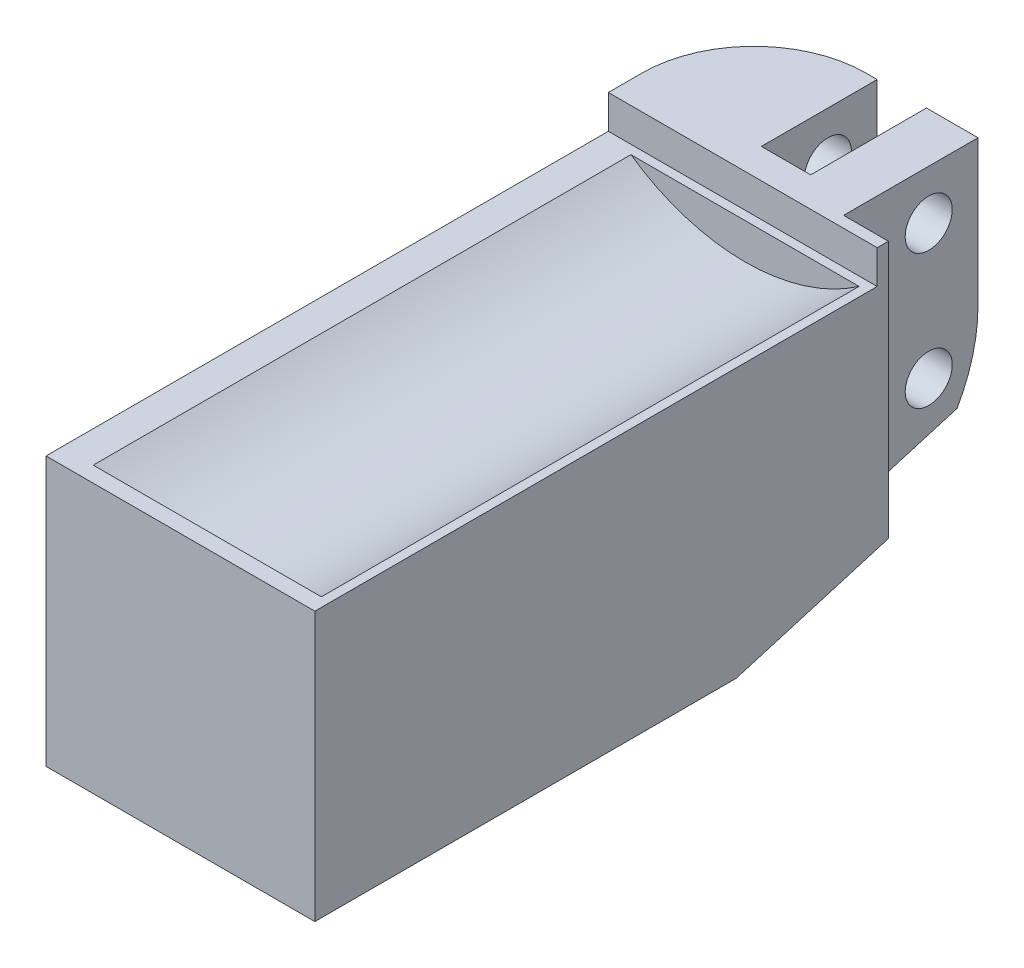
ISO-10303-21;
HEADER;
FILE_DESCRIPTION(('STEP AP214'),'2;1');
FILE_NAME('part.step','',(''),(''),'','','');
FILE_SCHEMA(('AUTOMOTIVE_DESIGN { 1 0 10303 214 1 1 1 1 }'));
ENDSEC;
DATA;
#1=APPLICATION_CONTEXT('core data for automotive mechanical design processes');
#2=APPLICATION_PROTOCOL_DEFINITION('international standard','automotive_design',2000,#1);
#3=PRODUCT_CONTEXT('',#1,'mechanical');
#4=PRODUCT('Part','Part','',(#3));
#5=PRODUCT_RELATED_PRODUCT_CATEGORY('part','',(#4));
#6=PRODUCT_DEFINITION_FORMATION('','',#4);
#7=PRODUCT_DEFINITION_CONTEXT('part definition',#1,'design');
#8=PRODUCT_DEFINITION('design','',#6,#7);
#9=PRODUCT_DEFINITION_SHAPE('','',#8);
#10=(LENGTH_UNIT() NAMED_UNIT(*) SI_UNIT(.MILLI.,.METRE.));
#11=(NAMED_UNIT(*) PLANE_ANGLE_UNIT() SI_UNIT($,.RADIAN.));
#12=(NAMED_UNIT(*) SI_UNIT($,.STERADIAN.) SOLID_ANGLE_UNIT());
#13=UNCERTAINTY_MEASURE_WITH_UNIT(LENGTH_MEASURE(1.E-05),#10,'distance_accuracy_value','');
#14=(GEOMETRIC_REPRESENTATION_CONTEXT(3) GLOBAL_UNCERTAINTY_ASSIGNED_CONTEXT((#13)) GLOBAL_UNIT_ASSIGNED_CONTEXT((#10,
#11,#12)) REPRESENTATION_CONTEXT('',''));
#15=CARTESIAN_POINT('',(0.,0.,0.));
#16=DIRECTION('',(0.,0.,1.));
#17=DIRECTION('',(1.,0.,0.));
#18=AXIS2_PLACEMENT_3D('',#15,#16,#17);
#19=CARTESIAN_POINT('',(119.,-32.5,-9.3));
#20=DIRECTION('',(-1.,0.,0.));
#21=DIRECTION('',(0.,0.,1.));
#22=AXIS2_PLACEMENT_3D('',#19,#20,#21);
#23=CYLINDRICAL_SURFACE('',#22,3.5);
#24=DIRECTION('',(-1.,0.,0.));
#25=VECTOR('',#24,1.);
#26=CARTESIAN_POINT('',(119.,-34.2494889216899,-12.3313839270017));
#27=LINE('',#26,#25);
#28=CARTESIAN_POINT('',(120.042783701327,-34.2494889216899,-12.3313839270017));
#29=VERTEX_POINT('',#28);
#30=CARTESIAN_POINT('',(121.75,-34.2494889216899,-12.3313839270017));
#31=VERTEX_POINT('',#30);
#32=EDGE_CURVE('E185',#29,#31,#27,.F.);
#33=ORIENTED_EDGE('',*,*,#32,.F.);
#34=CARTESIAN_POINT('',(119.,-35.8541019662497,-10.3));
#35=CARTESIAN_POINT('',(118.999988047983,-35.8338175600791,-10.3680954157907));
#36=CARTESIAN_POINT('',(119.002781171359,-35.811438180757,-10.435528450473));
#37=CARTESIAN_POINT('',(119.013566583995,-35.7628159711116,-10.5684645695911));
#38=CARTESIAN_POINT('',(119.021551963303,-35.7365783113211,-10.6339700982563));
#39=CARTESIAN_POINT('',(119.042216839472,-35.6807703446585,-10.7620335653267));
#40=CARTESIAN_POINT('',(119.054852155966,-35.6512331700846,-10.8246131915429));
#41=CARTESIAN_POINT('',(119.084383184073,-35.5889660439499,-10.9471235207846));
#42=CARTESIAN_POINT('',(119.101280246841,-35.5562350818447,-11.0070533766252));
#43=CARTESIAN_POINT('',(119.157500642327,-35.4541264746393,-11.1818187198834));
#44=CARTESIAN_POINT('',(119.202488569198,-35.3804884441263,-11.2924089484076));
#45=CARTESIAN_POINT('',(119.304426326725,-35.2242537722305,-11.5012606983842));
#46=CARTESIAN_POINT('',(119.361408356519,-35.141633311444,-11.599487872419));
#47=CARTESIAN_POINT('',(119.520936962632,-34.9187893227612,-11.8376213129414));
#48=CARTESIAN_POINT('',(119.63053498836,-34.7733331522809,-11.9679384212429));
#49=CARTESIAN_POINT('',(119.86503353588,-34.4711432111932,-12.1984267336067));
#50=CARTESIAN_POINT('',(119.989971928102,-34.3143819417854,-12.2985211337983));
#51=CARTESIAN_POINT('',(120.207804917403,-34.0454260941259,-12.4427442612138));
#52=CARTESIAN_POINT('',(120.298084557525,-33.9351101595503,-12.4945194265165));
#53=CARTESIAN_POINT('',(120.48194455528,-33.7120916329477,-12.5856289266947));
#54=CARTESIAN_POINT('',(120.575526318667,-33.5993880328242,-12.6249578902832));
#55=CARTESIAN_POINT('',(120.859321598635,-33.2592425154894,-12.7248113278427));
#56=CARTESIAN_POINT('',(121.053053297697,-33.0291935020995,-12.7675000629));
#57=CARTESIAN_POINT('',(121.329168210894,-32.7021354234193,-12.7954968708602));
#58=CARTESIAN_POINT('',(121.410759511203,-32.6055909071279,-12.7997391135888));
#59=CARTESIAN_POINT('',(121.494908240545,-32.5060246498733,-12.7999961085257));
#60=CARTESIAN_POINT('',(121.497454117018,-32.5030123281731,-12.7999999972126));
#61=CARTESIAN_POINT('',(121.5,-32.5,-12.8));
#62=B_SPLINE_CURVE_WITH_KNOTS('',3,(#34,#35,#36,#37,#38,#39,#40,#41,#42,#43,#44,#45,#46,#47,#48,
#49,#50,#51,#52,#53,#54,#55,#56,#57,#58,#59,#60,#61),.UNSPECIFIED.,.F.,.F.,(4,2,2,2,2,2,2,2,2,2,
2,2,2,4),(0.,0.213014333672373,0.42574576248234,0.636506063228314,0.847333268093255,
1.26643070813804,1.68666793580815,2.3547711927174,3.02455825693559,3.4789654617576,
3.9335685041186,4.84041086672273,5.21966840636038,5.23150057167835),.UNSPECIFIED.);
#63=CARTESIAN_POINT('',(121.5,-32.5,-12.8));
#64=VERTEX_POINT('',#63);
#65=EDGE_CURVE('E248',#64,#29,#62,.F.);
#66=ORIENTED_EDGE('',*,*,#65,.F.);
#67=DIRECTION('',(1.,0.,0.));
#68=VECTOR('',#67,1.);
#69=CARTESIAN_POINT('',(119.,-32.5,-12.8));
#70=LINE('',#69,#68);
#71=CARTESIAN_POINT('',(121.75,-32.5,-12.8));
#72=VERTEX_POINT('',#71);
#73=EDGE_CURVE('E60',#72,#64,#70,.F.);
#74=ORIENTED_EDGE('',*,*,#73,.F.);
#75=CARTESIAN_POINT('',(121.75,-32.5,-9.3));
#76=DIRECTION('',(-1.,0.,0.));
#77=DIRECTION('',(0.,-1.,0.));
#78=AXIS2_PLACEMENT_3D('',#75,#76,#77);
#79=CIRCLE('',#78,3.5);
#80=EDGE_CURVE('E46',#31,#72,#79,.F.);
#81=ORIENTED_EDGE('',*,*,#80,.F.);
#82=EDGE_LOOP('',(#33,#66,#74,#81));
#83=FACE_BOUND('',#82,.T.);
#84=ADVANCED_FACE('F37',(#83),#23,.T.);
#85=CARTESIAN_POINT('',(0.,0.,-12.8));
#86=DIRECTION('',(0.,0.,1.));
#87=DIRECTION('',(1.,0.,0.));
#88=AXIS2_PLACEMENT_3D('',#85,#86,#87);
#89=PLANE('',#88);
#90=DIRECTION('',(0.,1.,0.));
#91=VECTOR('',#90,1.);
#92=CARTESIAN_POINT('',(124.,-36.,-12.8));
#93=LINE('',#92,#91);
#94=CARTESIAN_POINT('',(124.,-32.5,-12.8));
#95=VERTEX_POINT('',#94);
#96=CARTESIAN_POINT('',(124.,-29.25,-12.8));
#97=VERTEX_POINT('',#96);
#98=EDGE_CURVE('E430',#95,#97,#93,.T.);
#99=ORIENTED_EDGE('',*,*,#98,.F.);
#100=DIRECTION('',(1.,0.,0.));
#101=VECTOR('',#100,1.);
#102=CARTESIAN_POINT('',(119.,-32.5,-12.8));
#103=LINE('',#102,#101);
#104=CARTESIAN_POINT('',(122.85,-32.5,-12.8));
#105=VERTEX_POINT('',#104);
#106=EDGE_CURVE('E238',#95,#105,#103,.F.);
#107=ORIENTED_EDGE('',*,*,#106,.T.);
#108=DIRECTION('',(0.,1.,0.));
#109=VECTOR('',#108,1.);
#110=CARTESIAN_POINT('',(122.85,0.,-12.8));
#111=LINE('',#110,#109);
#112=CARTESIAN_POINT('',(122.85,-29.25,-12.8));
#113=VERTEX_POINT('',#112);
#114=EDGE_CURVE('E373',#105,#113,#111,.T.);
#115=ORIENTED_EDGE('',*,*,#114,.T.);
#116=DIRECTION('',(-1.,0.,0.));
#117=VECTOR('',#116,1.);
#118=CARTESIAN_POINT('',(119.,-29.25,-12.8));
#119=LINE('',#118,#117);
#120=EDGE_CURVE('E386',#97,#113,#119,.T.);
#121=ORIENTED_EDGE('',*,*,#120,.F.);
#122=EDGE_LOOP('',(#99,#107,#115,#121));
#123=FACE_BOUND('',#122,.T.);
#124=ADVANCED_FACE('F271',(#123),#89,.F.);
#125=CARTESIAN_POINT('',(119.,-30.,-12.8));
#126=DIRECTION('',(-1.,0.,0.));
#127=DIRECTION('',(0.,0.,1.));
#128=AXIS2_PLACEMENT_3D('',#125,#126,#127);
#129=PLANE('',#128);
#130=DIRECTION('',(0.,0.283267438048704,-0.959040957697493));
#131=VECTOR('',#130,1.);
#132=CARTESIAN_POINT('',(119.,-36.,-6.40478737722839));
#133=LINE('',#132,#131);
#134=CARTESIAN_POINT('',(119.,-36.,-6.40478737722839));
#135=VERTEX_POINT('',#134);
#136=CARTESIAN_POINT('',(119.,-34.8494892825469,-10.3));
#137=VERTEX_POINT('',#136);
#138=EDGE_CURVE('E52',#135,#137,#133,.T.);
#139=ORIENTED_EDGE('',*,*,#138,.F.);
#140=DIRECTION('',(0.,0.,1.));
#141=VECTOR('',#140,1.);
#142=CARTESIAN_POINT('',(119.,-36.,-12.8));
#143=LINE('',#142,#141);
#144=CARTESIAN_POINT('',(119.,-36.,3.));
#145=VERTEX_POINT('',#144);
#146=EDGE_CURVE('E184',#135,#145,#143,.T.);
#147=ORIENTED_EDGE('',*,*,#146,.T.);
#148=DIRECTION('',(0.,-1.,0.));
#149=VECTOR('',#148,1.);
#150=CARTESIAN_POINT('',(119.,-30.,3.));
#151=LINE('',#150,#149);
#152=CARTESIAN_POINT('',(119.,-30.,3.));
#153=VERTEX_POINT('',#152);
#154=EDGE_CURVE('E397',#153,#145,#151,.T.);
#155=ORIENTED_EDGE('',*,*,#154,.F.);
#156=DIRECTION('',(0.,0.,1.));
#157=VECTOR('',#156,1.);
#158=CARTESIAN_POINT('',(119.,-30.,-12.8));
#159=LINE('',#158,#157);
#160=CARTESIAN_POINT('',(119.,-30.,-9.55));
#161=VERTEX_POINT('',#160);
#162=EDGE_CURVE('E193',#161,#153,#159,.T.);
#163=ORIENTED_EDGE('',*,*,#162,.F.);
#164=DIRECTION('',(0.,-1.,0.));
#165=VECTOR('',#164,1.);
#166=CARTESIAN_POINT('',(119.,-29.25,-9.55));
#167=LINE('',#166,#165);
#168=CARTESIAN_POINT('',(119.,-29.25,-9.55));
#169=VERTEX_POINT('',#168);
#170=EDGE_CURVE('E394',#169,#161,#167,.T.);
#171=ORIENTED_EDGE('',*,*,#170,.F.);
#172=DIRECTION('',(0.,0.,1.));
#173=VECTOR('',#172,1.);
#174=CARTESIAN_POINT('',(119.,-29.25,-12.8));
#175=LINE('',#174,#173);
#176=CARTESIAN_POINT('',(119.,-29.25,-10.3));
#177=VERTEX_POINT('',#176);
#178=EDGE_CURVE('E378',#177,#169,#175,.T.);
#179=ORIENTED_EDGE('',*,*,#178,.F.);
#180=DIRECTION('',(0.,-1.,0.));
#181=VECTOR('',#180,1.);
#182=CARTESIAN_POINT('',(119.,-36.,-10.3));
#183=LINE('',#182,#181);
#184=EDGE_CURVE('E218',#177,#137,#183,.T.);
#185=ORIENTED_EDGE('',*,*,#184,.T.);
#186=EDGE_LOOP('',(#139,#147,#155,#163,#171,#179,#185));
#187=FACE_BOUND('',#186,.T.);
#188=ADVANCED_FACE('F267',(#187),#129,.T.);
#189=CARTESIAN_POINT('',(119.,-30.,-12.8));
#190=DIRECTION('',(0.,1.,0.));
#191=DIRECTION('',(0.,0.,1.));
#192=AXIS2_PLACEMENT_3D('',#189,#190,#191);
#193=PLANE('',#192);
#194=DIRECTION('',(-1.,0.,0.));
#195=VECTOR('',#194,1.);
#196=CARTESIAN_POINT('',(119.,-30.,-9.35000000000001));
#197=LINE('',#196,#195);
#198=CARTESIAN_POINT('',(124.795584412272,-30.,-9.35000000000001));
#199=VERTEX_POINT('',#198);
#200=CARTESIAN_POINT('',(119.704415587728,-30.,-9.35000000000001));
#201=VERTEX_POINT('',#200);
#202=EDGE_CURVE('E216',#199,#201,#197,.T.);
#203=ORIENTED_EDGE('',*,*,#202,.F.);
#204=DIRECTION('',(0.,0.,1.));
#205=VECTOR('',#204,1.);
#206=CARTESIAN_POINT('',(124.795584412272,-30.,-9.35000000000001));
#207=LINE('',#206,#205);
#208=CARTESIAN_POINT('',(124.795584412272,-30.,2.64999999999999));
#209=VERTEX_POINT('',#208);
#210=EDGE_CURVE('E210',#199,#209,#207,.T.);
#211=ORIENTED_EDGE('',*,*,#210,.T.);
#212=DIRECTION('',(-1.,0.,0.));
#213=VECTOR('',#212,1.);
#214=CARTESIAN_POINT('',(119.,-30.,2.64999999999999));
#215=LINE('',#214,#213);
#216=CARTESIAN_POINT('',(119.704415587728,-30.,2.64999999999999));
#217=VERTEX_POINT('',#216);
#218=EDGE_CURVE('E207',#209,#217,#215,.T.);
#219=ORIENTED_EDGE('',*,*,#218,.T.);
#220=DIRECTION('',(0.,0.,1.));
#221=VECTOR('',#220,1.);
#222=CARTESIAN_POINT('',(119.704415587728,-30.,-9.35000000000001));
#223=LINE('',#222,#221);
#224=EDGE_CURVE('E213',#217,#201,#223,.F.);
#225=ORIENTED_EDGE('',*,*,#224,.T.);
#226=EDGE_LOOP('',(#203,#211,#219,#225));
#227=FACE_BOUND('',#226,.T.);
#228=DIRECTION('',(1.,0.,0.));
#229=VECTOR('',#228,1.);
#230=CARTESIAN_POINT('',(119.,-30.,-9.55));
#231=LINE('',#230,#229);
#232=CARTESIAN_POINT('',(125.,-30.,-9.55));
#233=VERTEX_POINT('',#232);
#234=EDGE_CURVE('E377',#161,#233,#231,.T.);
#235=ORIENTED_EDGE('',*,*,#234,.F.);
#236=ORIENTED_EDGE('',*,*,#162,.T.);
#237=DIRECTION('',(-1.,0.,0.));
#238=VECTOR('',#237,1.);
#239=CARTESIAN_POINT('',(119.,-30.,3.));
#240=LINE('',#239,#238);
#241=CARTESIAN_POINT('',(125.,-30.,3.));
#242=VERTEX_POINT('',#241);
#243=EDGE_CURVE('E195',#242,#153,#240,.T.);
#244=ORIENTED_EDGE('',*,*,#243,.F.);
#245=DIRECTION('',(0.,0.,1.));
#246=VECTOR('',#245,1.);
#247=CARTESIAN_POINT('',(125.,-30.,-12.8));
#248=LINE('',#247,#246);
#249=EDGE_CURVE('E191',#233,#242,#248,.T.);
#250=ORIENTED_EDGE('',*,*,#249,.F.);
#251=EDGE_LOOP('',(#235,#236,#244,#250));
#252=FACE_BOUND('',#251,.T.);
#253=ADVANCED_FACE('F270',(#227,#252),#193,.T.);
#254=CARTESIAN_POINT('',(125.,-30.,-12.8));
#255=DIRECTION('',(1.,0.,0.));
#256=DIRECTION('',(0.,0.,-1.));
#257=AXIS2_PLACEMENT_3D('',#254,#255,#256);
#258=PLANE('',#257);
#259=DIRECTION('',(0.,0.283267438048704,-0.959040957697493));
#260=VECTOR('',#259,1.);
#261=CARTESIAN_POINT('',(125.,-36.,-6.40478737722839));
#262=LINE('',#261,#260);
#263=CARTESIAN_POINT('',(125.,-36.,-6.40478737722839));
#264=VERTEX_POINT('',#263);
#265=CARTESIAN_POINT('',(125.,-34.9971719418614,-9.8));
#266=VERTEX_POINT('',#265);
#267=EDGE_CURVE('E167',#264,#266,#262,.T.);
#268=ORIENTED_EDGE('',*,*,#267,.T.);
#269=DIRECTION('',(0.,-1.,0.));
#270=VECTOR('',#269,1.);
#271=CARTESIAN_POINT('',(125.,-36.,-9.8));
#272=LINE('',#271,#270);
#273=CARTESIAN_POINT('',(125.,-29.25,-9.8));
#274=VERTEX_POINT('',#273);
#275=EDGE_CURVE('E255',#274,#266,#272,.T.);
#276=ORIENTED_EDGE('',*,*,#275,.F.);
#277=DIRECTION('',(0.,0.,-1.));
#278=VECTOR('',#277,1.);
#279=CARTESIAN_POINT('',(125.,-29.25,-12.8));
#280=LINE('',#279,#278);
#281=CARTESIAN_POINT('',(125.,-29.25,-9.55));
#282=VERTEX_POINT('',#281);
#283=EDGE_CURVE('E382',#282,#274,#280,.T.);
#284=ORIENTED_EDGE('',*,*,#283,.F.);
#285=DIRECTION('',(0.,-1.,0.));
#286=VECTOR('',#285,1.);
#287=CARTESIAN_POINT('',(125.,-29.25,-9.55));
#288=LINE('',#287,#286);
#289=EDGE_CURVE('E389',#282,#233,#288,.T.);
#290=ORIENTED_EDGE('',*,*,#289,.T.);
#291=ORIENTED_EDGE('',*,*,#249,.T.);
#292=DIRECTION('',(0.,1.,0.));
#293=VECTOR('',#292,1.);
#294=CARTESIAN_POINT('',(125.,-30.,3.));
#295=LINE('',#294,#293);
#296=CARTESIAN_POINT('',(125.,-36.,3.));
#297=VERTEX_POINT('',#296);
#298=EDGE_CURVE('E190',#297,#242,#295,.T.);
#299=ORIENTED_EDGE('',*,*,#298,.F.);
#300=DIRECTION('',(0.,0.,1.));
#301=VECTOR('',#300,1.);
#302=CARTESIAN_POINT('',(125.,-36.,-12.8));
#303=LINE('',#302,#301);
#304=EDGE_CURVE('E182',#264,#297,#303,.T.);
#305=ORIENTED_EDGE('',*,*,#304,.F.);
#306=EDGE_LOOP('',(#268,#276,#284,#290,#291,#299,#305));
#307=FACE_BOUND('',#306,.T.);
#308=ADVANCED_FACE('F188',(#307),#258,.T.);
#309=CARTESIAN_POINT('',(119.,-36.,-12.8));
#310=DIRECTION('',(0.,-1.,0.));
#311=DIRECTION('',(0.,0.,-1.));
#312=AXIS2_PLACEMENT_3D('',#309,#310,#311);
#313=PLANE('',#312);
#314=DIRECTION('',(-1.,0.,0.));
#315=VECTOR('',#314,1.);
#316=CARTESIAN_POINT('',(125.,-36.,-6.40478737722839));
#317=LINE('',#316,#315);
#318=EDGE_CURVE('E170',#264,#135,#317,.T.);
#319=ORIENTED_EDGE('',*,*,#318,.F.);
#320=ORIENTED_EDGE('',*,*,#304,.T.);
#321=DIRECTION('',(1.,0.,0.));
#322=VECTOR('',#321,1.);
#323=CARTESIAN_POINT('',(119.,-36.,3.));
#324=LINE('',#323,#322);
#325=EDGE_CURVE('E400',#145,#297,#324,.T.);
#326=ORIENTED_EDGE('',*,*,#325,.F.);
#327=ORIENTED_EDGE('',*,*,#146,.F.);
#328=EDGE_LOOP('',(#319,#320,#326,#327));
#329=FACE_BOUND('',#328,.T.);
#330=ADVANCED_FACE('F180',(#329),#313,.T.);
#331=ORIENTED_EDGE('',*,*,#73,.T.);
#332=DIRECTION('',(0.,-1.,0.));
#333=VECTOR('',#332,1.);
#334=CARTESIAN_POINT('',(121.5,-29.25,-12.8));
#335=LINE('',#334,#333);
#336=CARTESIAN_POINT('',(121.5,-29.25,-12.8));
#337=VERTEX_POINT('',#336);
#338=EDGE_CURVE('E236',#64,#337,#335,.F.);
#339=ORIENTED_EDGE('',*,*,#338,.T.);
#340=CARTESIAN_POINT('',(121.75,-29.25,-12.8));
#341=VERTEX_POINT('',#340);
#342=EDGE_CURVE('E385',#341,#337,#119,.T.);
#343=ORIENTED_EDGE('',*,*,#342,.F.);
#344=DIRECTION('',(0.,-1.,0.));
#345=VECTOR('',#344,1.);
#346=CARTESIAN_POINT('',(121.75,0.,-12.8));
#347=LINE('',#346,#345);
#348=EDGE_CURVE('E375',#341,#72,#347,.T.);
#349=ORIENTED_EDGE('',*,*,#348,.T.);
#350=EDGE_LOOP('',(#331,#339,#343,#349));
#351=FACE_BOUND('',#350,.T.);
#352=ADVANCED_FACE('F275',(#351),#89,.F.);
#353=CARTESIAN_POINT('',(0.,0.,3.));
#354=DIRECTION('',(0.,0.,1.));
#355=DIRECTION('',(1.,0.,0.));
#356=AXIS2_PLACEMENT_3D('',#353,#354,#355);
#357=PLANE('',#356);
#358=ORIENTED_EDGE('',*,*,#154,.T.);
#359=ORIENTED_EDGE('',*,*,#325,.T.);
#360=ORIENTED_EDGE('',*,*,#298,.T.);
#361=ORIENTED_EDGE('',*,*,#243,.T.);
#362=EDGE_LOOP('',(#358,#359,#360,#361));
#363=FACE_BOUND('',#362,.T.);
#364=ADVANCED_FACE('F283',(#363),#357,.T.);
#365=CARTESIAN_POINT('',(119.,-29.25,-9.55));
#366=DIRECTION('',(0.,0.,-1.));
#367=DIRECTION('',(-1.,0.,0.));
#368=AXIS2_PLACEMENT_3D('',#365,#366,#367);
#369=PLANE('',#368);
#370=ORIENTED_EDGE('',*,*,#234,.T.);
#371=ORIENTED_EDGE('',*,*,#289,.F.);
#372=DIRECTION('',(1.,0.,0.));
#373=VECTOR('',#372,1.);
#374=CARTESIAN_POINT('',(119.,-29.25,-9.55));
#375=LINE('',#374,#373);
#376=EDGE_CURVE('E380',#169,#282,#375,.T.);
#377=ORIENTED_EDGE('',*,*,#376,.F.);
#378=ORIENTED_EDGE('',*,*,#170,.T.);
#379=EDGE_LOOP('',(#370,#371,#377,#378));
#380=FACE_BOUND('',#379,.T.);
#381=ADVANCED_FACE('F286',(#380),#369,.F.);
#382=CARTESIAN_POINT('',(0.,-29.25,0.));
#383=DIRECTION('',(0.,1.,0.));
#384=DIRECTION('',(0.,0.,1.));
#385=AXIS2_PLACEMENT_3D('',#382,#383,#384);
#386=PLANE('',#385);
#387=ORIENTED_EDGE('',*,*,#342,.T.);
#388=CARTESIAN_POINT('',(121.5,-29.25,-10.3));
#389=DIRECTION('',(0.,1.,0.));
#390=DIRECTION('',(0.,0.,1.));
#391=AXIS2_PLACEMENT_3D('',#388,#389,#390);
#392=CIRCLE('',#391,2.5);
#393=EDGE_CURVE('E240',#337,#177,#392,.T.);
#394=ORIENTED_EDGE('',*,*,#393,.T.);
#395=ORIENTED_EDGE('',*,*,#178,.T.);
#396=ORIENTED_EDGE('',*,*,#376,.T.);
#397=ORIENTED_EDGE('',*,*,#283,.T.);
#398=DIRECTION('',(1.,0.,0.));
#399=VECTOR('',#398,1.);
#400=CARTESIAN_POINT('',(124.,-29.25,-9.8));
#401=LINE('',#400,#399);
#402=CARTESIAN_POINT('',(124.,-29.25,-9.8));
#403=VERTEX_POINT('',#402);
#404=EDGE_CURVE('E232',#403,#274,#401,.T.);
#405=ORIENTED_EDGE('',*,*,#404,.F.);
#406=DIRECTION('',(0.,0.,1.));
#407=VECTOR('',#406,1.);
#408=CARTESIAN_POINT('',(124.,-29.25,-9.8));
#409=LINE('',#408,#407);
#410=EDGE_CURVE('E432',#97,#403,#409,.T.);
#411=ORIENTED_EDGE('',*,*,#410,.F.);
#412=ORIENTED_EDGE('',*,*,#120,.T.);
#413=DIRECTION('',(0.,0.,-1.));
#414=VECTOR('',#413,1.);
#415=CARTESIAN_POINT('',(122.85,-29.25,0.));
#416=LINE('',#415,#414);
#417=CARTESIAN_POINT('',(122.85,-29.25,-10.2151462676297));
#418=VERTEX_POINT('',#417);
#419=EDGE_CURVE('E199',#418,#113,#416,.T.);
#420=ORIENTED_EDGE('',*,*,#419,.F.);
#421=DIRECTION('',(-1.,0.,0.));
#422=VECTOR('',#421,1.);
#423=CARTESIAN_POINT('',(0.,-29.25,-10.2151462676297));
#424=LINE('',#423,#422);
#425=CARTESIAN_POINT('',(121.75,-29.25,-10.2151462676297));
#426=VERTEX_POINT('',#425);
#427=EDGE_CURVE('E202',#418,#426,#424,.T.);
#428=ORIENTED_EDGE('',*,*,#427,.T.);
#429=DIRECTION('',(0.,0.,1.));
#430=VECTOR('',#429,1.);
#431=CARTESIAN_POINT('',(121.75,-29.25,0.));
#432=LINE('',#431,#430);
#433=EDGE_CURVE('E205',#341,#426,#432,.T.);
#434=ORIENTED_EDGE('',*,*,#433,.F.);
#435=EDGE_LOOP('',(#387,#394,#395,#396,#397,#405,#411,#412,#420,#428,#434));
#436=FACE_BOUND('',#435,.T.);
#437=ADVANCED_FACE('F290',(#436),#386,.T.);
#438=CARTESIAN_POINT('',(121.75,-33.3500000000001,-11.7769698678022));
#439=DIRECTION('',(-1.,0.,0.));
#440=DIRECTION('',(0.,-1.,0.));
#441=AXIS2_PLACEMENT_3D('',#438,#439,#440);
#442=PLANE('',#441);
#443=CARTESIAN_POINT('',(121.75,-33.35,-11.7));
#444=DIRECTION('',(-1.,0.,0.));
#445=DIRECTION('',(0.,-1.,0.));
#446=AXIS2_PLACEMENT_3D('',#443,#444,#445);
#447=CIRCLE('',#446,0.524999999999999);
#448=CARTESIAN_POINT('',(121.75,-33.875,-11.7));
#449=VERTEX_POINT('',#448);
#450=EDGE_CURVE('E227',#449,#449,#447,.T.);
#451=ORIENTED_EDGE('',*,*,#450,.T.);
#452=EDGE_LOOP('',(#451));
#453=FACE_BOUND('',#452,.T.);
#454=CARTESIAN_POINT('',(121.75,-30.3500000000001,-11.7));
#455=DIRECTION('',(-1.,0.,0.));
#456=DIRECTION('',(0.,-1.,0.));
#457=AXIS2_PLACEMENT_3D('',#454,#455,#456);
#458=CIRCLE('',#457,0.525);
#459=CARTESIAN_POINT('',(121.75,-30.8750000000001,-11.7));
#460=VERTEX_POINT('',#459);
#461=EDGE_CURVE('E222',#460,#460,#458,.T.);
#462=ORIENTED_EDGE('',*,*,#461,.T.);
#463=EDGE_LOOP('',(#462));
#464=FACE_BOUND('',#463,.T.);
#465=CARTESIAN_POINT('',(121.75,-33.35,-11.6233462518556));
#466=DIRECTION('',(-1.,0.,0.));
#467=DIRECTION('',(0.,-1.,0.));
#468=AXIS2_PLACEMENT_3D('',#465,#466,#467);
#469=CIRCLE('',#468,1.15000000000006);
#470=CARTESIAN_POINT('',(121.75,-34.4938110178812,-11.5041977924709));
#471=VERTEX_POINT('',#470);
#472=CARTESIAN_POINT('',(121.75,-33.421654476752,-10.4755807549175));
#473=VERTEX_POINT('',#472);
#474=EDGE_CURVE('E364',#471,#473,#469,.T.);
#475=ORIENTED_EDGE('',*,*,#474,.F.);
#476=DIRECTION('',(0.,0.283267438048704,-0.959040957697493));
#477=VECTOR('',#476,1.);
#478=CARTESIAN_POINT('',(121.75,-34.327928470539,-12.0658160220994));
#479=LINE('',#478,#477);
#480=EDGE_CURVE('E414',#471,#31,#479,.T.);
#481=ORIENTED_EDGE('',*,*,#480,.T.);
#482=ORIENTED_EDGE('',*,*,#80,.T.);
#483=ORIENTED_EDGE('',*,*,#348,.F.);
#484=ORIENTED_EDGE('',*,*,#433,.T.);
#485=DIRECTION('',(0.,0.998056953859155,0.0623082406538979));
#486=VECTOR('',#485,1.);
#487=CARTESIAN_POINT('',(121.75,-33.421654476752,-10.4755807549175));
#488=LINE('',#487,#486);
#489=EDGE_CURVE('E367',#473,#426,#488,.T.);
#490=ORIENTED_EDGE('',*,*,#489,.F.);
#491=EDGE_LOOP('',(#475,#481,#482,#483,#484,#490));
#492=FACE_BOUND('',#491,.T.);
#493=ADVANCED_FACE('F294',(#453,#464,#492),#442,.F.);
#494=CARTESIAN_POINT('',(122.85,-25.7050000000001,-13.62));
#495=DIRECTION('',(1.,0.,0.));
#496=DIRECTION('',(0.,-1.,0.));
#497=AXIS2_PLACEMENT_3D('',#494,#495,#496);
#498=PLANE('',#497);
#499=CARTESIAN_POINT('',(122.85,-33.35,-11.7));
#500=DIRECTION('',(1.,0.,0.));
#501=DIRECTION('',(0.,1.,0.));
#502=AXIS2_PLACEMENT_3D('',#499,#500,#501);
#503=CIRCLE('',#502,0.524999999999999);
#504=CARTESIAN_POINT('',(122.85,-32.825,-11.7));
#505=VERTEX_POINT('',#504);
#506=EDGE_CURVE('E224',#505,#505,#503,.T.);
#507=ORIENTED_EDGE('',*,*,#506,.T.);
#508=EDGE_LOOP('',(#507));
#509=FACE_BOUND('',#508,.T.);
#510=CARTESIAN_POINT('',(122.85,-30.3500000000001,-11.7));
#511=DIRECTION('',(1.,0.,0.));
#512=DIRECTION('',(0.,1.,0.));
#513=AXIS2_PLACEMENT_3D('',#510,#511,#512);
#514=CIRCLE('',#513,0.525);
#515=CARTESIAN_POINT('',(122.85,-29.8250000000001,-11.7));
#516=VERTEX_POINT('',#515);
#517=EDGE_CURVE('E219',#516,#516,#514,.T.);
#518=ORIENTED_EDGE('',*,*,#517,.T.);
#519=EDGE_LOOP('',(#518));
#520=FACE_BOUND('',#519,.T.);
#521=CARTESIAN_POINT('',(122.85,-32.5,-9.3));
#522=DIRECTION('',(1.,0.,0.));
#523=DIRECTION('',(0.,1.,0.));
#524=AXIS2_PLACEMENT_3D('',#521,#522,#523);
#525=CIRCLE('',#524,3.5);
#526=CARTESIAN_POINT('',(122.85,-34.2494889216899,-12.3313839270017));
#527=VERTEX_POINT('',#526);
#528=EDGE_CURVE('E244',#105,#527,#525,.F.);
#529=ORIENTED_EDGE('',*,*,#528,.T.);
#530=DIRECTION('',(0.,-0.283267438048704,0.959040957697493));
#531=VECTOR('',#530,1.);
#532=CARTESIAN_POINT('',(122.85,-33.2138033763663,-15.8378401017839));
#533=LINE('',#532,#531);
#534=CARTESIAN_POINT('',(122.85,-34.4938110178812,-11.5041977924709));
#535=VERTEX_POINT('',#534);
#536=EDGE_CURVE('E420',#527,#535,#533,.T.);
#537=ORIENTED_EDGE('',*,*,#536,.T.);
#538=CARTESIAN_POINT('',(122.85,-33.35,-11.6233462518556));
#539=DIRECTION('',(1.,0.,0.));
#540=DIRECTION('',(0.,1.,0.));
#541=AXIS2_PLACEMENT_3D('',#538,#539,#540);
#542=CIRCLE('',#541,1.15000000000006);
#543=CARTESIAN_POINT('',(122.85,-33.421654476752,-10.4755807549175));
#544=VERTEX_POINT('',#543);
#545=EDGE_CURVE('E361',#535,#544,#542,.F.);
#546=ORIENTED_EDGE('',*,*,#545,.T.);
#547=DIRECTION('',(0.,0.998056953859155,0.0623082406538979));
#548=VECTOR('',#547,1.);
#549=CARTESIAN_POINT('',(122.85,-33.421654476752,-10.4755807549175));
#550=LINE('',#549,#548);
#551=EDGE_CURVE('E362',#544,#418,#550,.T.);
#552=ORIENTED_EDGE('',*,*,#551,.T.);
#553=ORIENTED_EDGE('',*,*,#419,.T.);
#554=ORIENTED_EDGE('',*,*,#114,.F.);
#555=EDGE_LOOP('',(#529,#537,#546,#552,#553,#554));
#556=FACE_BOUND('',#555,.T.);
#557=ADVANCED_FACE('F300',(#509,#520,#556),#498,.F.);
#558=CARTESIAN_POINT('',(121.75,-33.35,-11.6233462518556));
#559=DIRECTION('',(1.,0.,0.));
#560=DIRECTION('',(0.,1.,0.));
#561=AXIS2_PLACEMENT_3D('',#558,#559,#560);
#562=CYLINDRICAL_SURFACE('',#561,1.15000000000006);
#563=DIRECTION('',(1.,0.,0.));
#564=VECTOR('',#563,1.);
#565=CARTESIAN_POINT('',(121.75,-34.4938110178812,-11.5041977924709));
#566=LINE('',#565,#564);
#567=EDGE_CURVE('E418',#471,#535,#566,.T.);
#568=ORIENTED_EDGE('',*,*,#567,.F.);
#569=ORIENTED_EDGE('',*,*,#474,.T.);
#570=DIRECTION('',(1.,0.,0.));
#571=VECTOR('',#570,1.);
#572=CARTESIAN_POINT('',(121.75,-33.421654476752,-10.4755807549175));
#573=LINE('',#572,#571);
#574=EDGE_CURVE('E370',#473,#544,#573,.T.);
#575=ORIENTED_EDGE('',*,*,#574,.T.);
#576=ORIENTED_EDGE('',*,*,#545,.F.);
#577=EDGE_LOOP('',(#568,#569,#575,#576));
#578=FACE_BOUND('',#577,.T.);
#579=ADVANCED_FACE('F296',(#578),#562,.F.);
#580=CARTESIAN_POINT('',(121.75,-33.421654476752,-10.4755807549175));
#581=DIRECTION('',(0.,0.0623082406538979,-0.998056953859155));
#582=DIRECTION('',(0.,0.998056953859155,0.0623082406538979));
#583=AXIS2_PLACEMENT_3D('',#580,#581,#582);
#584=PLANE('',#583);
#585=ORIENTED_EDGE('',*,*,#551,.F.);
#586=ORIENTED_EDGE('',*,*,#574,.F.);
#587=ORIENTED_EDGE('',*,*,#489,.T.);
#588=ORIENTED_EDGE('',*,*,#427,.F.);
#589=EDGE_LOOP('',(#585,#586,#587,#588));
#590=FACE_BOUND('',#589,.T.);
#591=ADVANCED_FACE('F299',(#590),#584,.T.);
#592=CARTESIAN_POINT('',(122.25,-26.3500000000001,-9.35000000000001));
#593=DIRECTION('',(0.,0.,1.));
#594=DIRECTION('',(1.,0.,0.));
#595=AXIS2_PLACEMENT_3D('',#592,#593,#594);
#596=CYLINDRICAL_SURFACE('',#595,4.45000000000001);
#597=CARTESIAN_POINT('',(122.25,-26.3500000000001,2.64999999999999));
#598=DIRECTION('',(0.,0.,-1.));
#599=DIRECTION('',(-1.,0.,0.));
#600=AXIS2_PLACEMENT_3D('',#597,#598,#599);
#601=CIRCLE('',#600,4.45000000000001);
#602=EDGE_CURVE('E356',#209,#217,#601,.T.);
#603=ORIENTED_EDGE('',*,*,#602,.F.);
#604=ORIENTED_EDGE('',*,*,#210,.F.);
#605=CARTESIAN_POINT('',(122.25,-26.3500000000001,-9.35000000000001));
#606=DIRECTION('',(0.,0.,-1.));
#607=DIRECTION('',(-1.,0.,0.));
#608=AXIS2_PLACEMENT_3D('',#605,#606,#607);
#609=CIRCLE('',#608,4.45000000000001);
#610=EDGE_CURVE('E358',#199,#201,#609,.T.);
#611=ORIENTED_EDGE('',*,*,#610,.T.);
#612=ORIENTED_EDGE('',*,*,#224,.F.);
#613=EDGE_LOOP('',(#603,#604,#611,#612));
#614=FACE_BOUND('',#613,.T.);
#615=ADVANCED_FACE('F304',(#614),#596,.F.);
#616=CARTESIAN_POINT('',(122.25,-26.3500000000001,-9.35000000000001));
#617=DIRECTION('',(0.,0.,-1.));
#618=DIRECTION('',(-1.,0.,0.));
#619=AXIS2_PLACEMENT_3D('',#616,#617,#618);
#620=PLANE('',#619);
#621=ORIENTED_EDGE('',*,*,#202,.T.);
#622=ORIENTED_EDGE('',*,*,#610,.F.);
#623=EDGE_LOOP('',(#621,#622));
#624=FACE_BOUND('',#623,.T.);
#625=ADVANCED_FACE('F314',(#624),#620,.F.);
#626=CARTESIAN_POINT('',(122.25,-26.3500000000001,2.64999999999999));
#627=DIRECTION('',(0.,0.,-1.));
#628=DIRECTION('',(-1.,0.,0.));
#629=AXIS2_PLACEMENT_3D('',#626,#627,#628);
#630=PLANE('',#629);
#631=ORIENTED_EDGE('',*,*,#602,.T.);
#632=ORIENTED_EDGE('',*,*,#218,.F.);
#633=EDGE_LOOP('',(#631,#632));
#634=FACE_BOUND('',#633,.T.);
#635=ADVANCED_FACE('F318',(#634),#630,.T.);
#636=CARTESIAN_POINT('',(117.515075759508,-30.3500000000001,-11.7));
#637=DIRECTION('',(1.,0.,0.));
#638=DIRECTION('',(0.,1.,0.));
#639=AXIS2_PLACEMENT_3D('',#636,#637,#638);
#640=CYLINDRICAL_SURFACE('',#639,0.525);
#641=CARTESIAN_POINT('',(124.,-30.3500000000001,-11.7));
#642=DIRECTION('',(-1.,0.,0.));
#643=DIRECTION('',(0.,0.,1.));
#644=AXIS2_PLACEMENT_3D('',#641,#642,#643);
#645=CIRCLE('',#644,0.525);
#646=CARTESIAN_POINT('',(124.,-30.3500000000001,-11.175));
#647=VERTEX_POINT('',#646);
#648=EDGE_CURVE('E231',#647,#647,#645,.F.);
#649=ORIENTED_EDGE('',*,*,#648,.T.);
#650=EDGE_LOOP('',(#649));
#651=FACE_BOUND('',#650,.T.);
#652=ORIENTED_EDGE('',*,*,#517,.F.);
#653=EDGE_LOOP('',(#652));
#654=FACE_BOUND('',#653,.T.);
#655=ADVANCED_FACE('F321',(#651,#654),#640,.F.);
#656=CARTESIAN_POINT('',(117.515075759508,-33.35,-11.7));
#657=DIRECTION('',(1.,0.,0.));
#658=DIRECTION('',(0.,1.,0.));
#659=AXIS2_PLACEMENT_3D('',#656,#657,#658);
#660=CYLINDRICAL_SURFACE('',#659,0.524999999999999);
#661=CARTESIAN_POINT('',(124.,-33.35,-11.7));
#662=DIRECTION('',(-1.,0.,0.));
#663=DIRECTION('',(0.,0.,1.));
#664=AXIS2_PLACEMENT_3D('',#661,#662,#663);
#665=CIRCLE('',#664,0.524999999999999);
#666=CARTESIAN_POINT('',(124.,-33.35,-11.175));
#667=VERTEX_POINT('',#666);
#668=EDGE_CURVE('E228',#667,#667,#665,.F.);
#669=ORIENTED_EDGE('',*,*,#668,.T.);
#670=EDGE_LOOP('',(#669));
#671=FACE_BOUND('',#670,.T.);
#672=ORIENTED_EDGE('',*,*,#506,.F.);
#673=EDGE_LOOP('',(#672));
#674=FACE_BOUND('',#673,.T.);
#675=ADVANCED_FACE('F328',(#671,#674),#660,.F.);
#676=CARTESIAN_POINT('',(119.904890285905,-30.3500000000001,-12.225));
#677=CARTESIAN_POINT('',(119.904887518637,-30.3272899451963,-12.2249981205352));
#678=CARTESIAN_POINT('',(119.903083842935,-30.3045326892996,-12.2235074650269));
#679=CARTESIAN_POINT('',(119.89611765769,-30.2598826518951,-12.2177018439149));
#680=CARTESIAN_POINT('',(119.890943722308,-30.2379930807934,-12.2133772704744));
#681=CARTESIAN_POINT('',(119.877935630616,-30.1959700982427,-12.2023611117051));
#682=CARTESIAN_POINT('',(119.870132618855,-30.1758194455153,-12.1956972015752));
#683=CARTESIAN_POINT('',(119.852517349918,-30.1372477289751,-12.1804088323799));
#684=CARTESIAN_POINT('',(119.842704878867,-30.1188268495731,-12.171784164613));
#685=CARTESIAN_POINT('',(119.81557981394,-30.0736633014225,-12.1474901413561));
#686=CARTESIAN_POINT('',(119.797194959418,-30.0482126049917,-12.130618631825));
#687=CARTESIAN_POINT('',(119.758387487238,-30.0014566547643,-12.0937416916032));
#688=CARTESIAN_POINT('',(119.737959417058,-29.9801629662133,-12.0737277895186));
#689=CARTESIAN_POINT('',(119.689823971511,-29.9358073929488,-12.0247497711238));
#690=CARTESIAN_POINT('',(119.661761260639,-29.9141091111535,-11.994895685773));
#691=CARTESIAN_POINT('',(119.605336513139,-29.8774178418658,-11.9315800744499));
#692=CARTESIAN_POINT('',(119.576974351235,-29.8624277845917,-11.8981169799318));
#693=CARTESIAN_POINT('',(119.520847988764,-29.8395212232251,-11.8280643245051));
#694=CARTESIAN_POINT('',(119.493087459623,-29.8316402366371,-11.7914600548465));
#695=CARTESIAN_POINT('',(119.439299972053,-29.8238944390795,-11.7162070564354));
#696=CARTESIAN_POINT('',(119.413270013339,-29.824015372147,-11.6775620861023));
#697=CARTESIAN_POINT('',(119.369862370888,-29.832076252812,-11.6090991629032));
#698=CARTESIAN_POINT('',(119.351917604056,-29.8381122457718,-11.5794141457974));
#699=CARTESIAN_POINT('',(119.317937813497,-29.8556662336322,-11.5205554337081));
#700=CARTESIAN_POINT('',(119.301901886866,-29.8671816237223,-11.4913815025885));
#701=CARTESIAN_POINT('',(119.271999657275,-29.8959635530945,-11.434484468445));
#702=CARTESIAN_POINT('',(119.258148336079,-29.9132674630376,-11.406772183737));
#703=CARTESIAN_POINT('',(119.23302973768,-29.9534513520882,-11.3543675257723));
#704=CARTESIAN_POINT('',(119.221760963129,-29.9763280841439,-11.329673406493));
#705=CARTESIAN_POINT('',(119.203132245049,-30.0240491862704,-11.2873554735222));
#706=CARTESIAN_POINT('',(119.195467568761,-30.0483404889501,-11.2692408111394));
#707=CARTESIAN_POINT('',(119.182287087504,-30.1001096006036,-11.2372869186006));
#708=CARTESIAN_POINT('',(119.176770209249,-30.1275858091008,-11.2234455537313));
#709=CARTESIAN_POINT('',(119.168213298773,-30.1825601750659,-11.2016084940047));
#710=CARTESIAN_POINT('',(119.165011872247,-30.2098846997187,-11.1932370234697));
#711=CARTESIAN_POINT('',(119.16037885409,-30.2656725221345,-11.1810313159049));
#712=CARTESIAN_POINT('',(119.158946865476,-30.2941355629853,-11.1771960611589));
#713=CARTESIAN_POINT('',(119.15785065619,-30.3504928561764,-11.1742646321134));
#714=CARTESIAN_POINT('',(119.158135571578,-30.378379143548,-11.1750320971993));
#715=CARTESIAN_POINT('',(119.160358179654,-30.4336125853833,-11.1809574370113));
#716=CARTESIAN_POINT('',(119.162295754384,-30.4609597781823,-11.1861149983956));
#717=CARTESIAN_POINT('',(119.167834004548,-30.5142340724871,-11.2005892126179));
#718=CARTESIAN_POINT('',(119.17142807328,-30.5401663618503,-11.2098893384994));
#719=CARTESIAN_POINT('',(119.180302702858,-30.5900233717434,-11.2322814527628));
#720=CARTESIAN_POINT('',(119.185583263067,-30.6139480930312,-11.2453734397132));
#721=CARTESIAN_POINT('',(119.197939607654,-30.659547241431,-11.275079357361));
#722=CARTESIAN_POINT('',(119.205042429491,-30.6811801576549,-11.2917456496041));
#723=CARTESIAN_POINT('',(119.220975885554,-30.7212727250887,-11.3278314216717));
#724=CARTESIAN_POINT('',(119.229806743219,-30.7397319653556,-11.3472512574453));
#725=CARTESIAN_POINT('',(119.249569783145,-30.7739398320137,-11.3890924391596));
#726=CARTESIAN_POINT('',(119.260580153558,-30.7895239793941,-11.4116109629591));
#727=CARTESIAN_POINT('',(119.284267616476,-30.8167324539191,-11.4581067746593));
#728=CARTESIAN_POINT('',(119.296945249422,-30.8283554926679,-11.48208453421));
#729=CARTESIAN_POINT('',(119.325021499367,-30.8485669919292,-11.5330409850811));
#730=CARTESIAN_POINT('',(119.340563475174,-30.8567733341958,-11.5600915546393));
#731=CARTESIAN_POINT('',(119.373113428231,-30.8687001106008,-11.6142888200513));
#732=CARTESIAN_POINT('',(119.39012207984,-30.8724184693053,-11.6414355545606));
#733=CARTESIAN_POINT('',(119.427822312552,-30.8759024227863,-11.6990811302275));
#734=CARTESIAN_POINT('',(119.448692079677,-30.8750239421717,-11.7295017347848));
#735=CARTESIAN_POINT('',(119.491478094766,-30.8682651288282,-11.7890221716601));
#736=CARTESIAN_POINT('',(119.513395085275,-30.8623811957292,-11.8181210373906));
#737=CARTESIAN_POINT('',(119.561478250233,-30.8446552049858,-11.8792028604277));
#738=CARTESIAN_POINT('',(119.587747398155,-30.8319883006941,-11.9108662115753));
#739=CARTESIAN_POINT('',(119.640267761608,-30.8007962103354,-11.9712261647179));
#740=CARTESIAN_POINT('',(119.66651895353,-30.7822671268879,-11.999920776101));
#741=CARTESIAN_POINT('',(119.714524417276,-30.7422892398448,-12.0501773102758));
#742=CARTESIAN_POINT('',(119.73641272641,-30.7215555583775,-12.0721803625267));
#743=CARTESIAN_POINT('',(119.778390101904,-30.6755940273982,-12.1129836081571));
#744=CARTESIAN_POINT('',(119.798482576879,-30.650374975841,-12.131789933114));
#745=CARTESIAN_POINT('',(119.829281049143,-30.6042597826329,-12.1598337625482));
#746=CARTESIAN_POINT('',(119.840904625112,-30.5846574661263,-12.1701869034954));
#747=CARTESIAN_POINT('',(119.86194329989,-30.5433014147036,-12.1886411317978));
#748=CARTESIAN_POINT('',(119.871361071635,-30.5215503295517,-12.1967449470544));
#749=CARTESIAN_POINT('',(119.885634764294,-30.480442653601,-12.208899208368));
#750=CARTESIAN_POINT('',(119.891016660104,-30.461411624472,-12.2134264598545));
#751=CARTESIAN_POINT('',(119.899284106964,-30.4224612732554,-12.2203485503495));
#752=CARTESIAN_POINT('',(119.902176871199,-30.4025446949859,-12.2227495515531));
#753=CARTESIAN_POINT('',(119.904080989734,-30.3770832724176,-12.2243291235376));
#754=CARTESIAN_POINT('',(119.904383879516,-30.3716751124068,-12.2245802938639));
#755=CARTESIAN_POINT('',(119.904788874125,-30.3608455337878,-12.2249159698684));
#756=CARTESIAN_POINT('',(119.904890946845,-30.3554241131981,-12.225000448895));
#757=CARTESIAN_POINT('',(119.904890285905,-30.3500000000001,-12.225));
#758=B_SPLINE_CURVE_WITH_KNOTS('',3,(#676,#677,#678,#679,#680,#681,#682,#683,#684,#685,#686,
#687,#688,#689,#690,#691,#692,#693,#694,#695,#696,#697,#698,#699,#700,#701,#702,#703,#704,#705,
#706,#707,#708,#709,#710,#711,#712,#713,#714,#715,#716,#717,#718,#719,#720,#721,#722,#723,#724,
#725,#726,#727,#728,#729,#730,#731,#732,#733,#734,#735,#736,#737,#738,#739,#740,#741,#742,#743,
#744,#745,#746,#747,#748,#749,#750,#751,#752,#753,#754,#755,#756,#757),.UNSPECIFIED.,.T.,.F.,(4,
2,2,2,2,2,2,2,2,2,2,2,2,2,2,2,2,2,2,2,2,2,2,2,2,2,2,2,2,2,2,2,2,2,2,2,2,2,2,2,4),(0.,
0.0681017219006403,0.136435532078168,0.203986755243286,0.271545171875266,0.377879178807476,
0.484504929507931,0.622900864834074,0.76135719399674,0.900501491569678,1.03939790082073,
1.14459902457156,1.24975018741822,1.35559374581946,1.46137578046834,1.55464181590108,
1.64786118489286,1.73370725953063,1.81953407063952,1.90283098065422,1.98612194587367,
2.06908355333043,2.15204512946632,2.23631704792112,2.32059987010986,2.40877366710843,
2.49697611633302,2.59337077874673,2.68981000108106,2.80009371518344,2.9104568223593,
3.03908335713164,3.16779558763592,3.27940486612599,3.39079759247533,3.46566651347604,
3.54044423541292,3.60107421433644,3.66152789785679,3.67779084417599,3.69405639050597),.UNSPECIFIED.);
#759=CARTESIAN_POINT('',(119.904890285905,-30.3500000000001,-12.225));
#760=VERTEX_POINT('',#759);
#761=EDGE_CURVE('E256',#760,#760,#758,.T.);
#762=ORIENTED_EDGE('',*,*,#761,.F.);
#763=EDGE_LOOP('',(#762));
#764=FACE_BOUND('',#763,.T.);
#765=ORIENTED_EDGE('',*,*,#461,.F.);
#766=EDGE_LOOP('',(#765));
#767=FACE_BOUND('',#766,.T.);
#768=ADVANCED_FACE('F323',(#764,#767),#640,.F.);
#769=CARTESIAN_POINT('',(119.904890285905,-33.35,-12.225));
#770=CARTESIAN_POINT('',(119.904887518637,-33.3272899451962,-12.2249981205352));
#771=CARTESIAN_POINT('',(119.903083842935,-33.3045326892995,-12.2235074650269));
#772=CARTESIAN_POINT('',(119.89611765769,-33.259882651895,-12.2177018439149));
#773=CARTESIAN_POINT('',(119.890943722308,-33.2379930807933,-12.2133772704744));
#774=CARTESIAN_POINT('',(119.877935630616,-33.1959700982426,-12.2023611117051));
#775=CARTESIAN_POINT('',(119.870132618855,-33.1758194455152,-12.1956972015752));
#776=CARTESIAN_POINT('',(119.852517349918,-33.137247728975,-12.1804088323799));
#777=CARTESIAN_POINT('',(119.842704878867,-33.118826849573,-12.171784164613));
#778=CARTESIAN_POINT('',(119.81557981394,-33.0736633014224,-12.1474901413561));
#779=CARTESIAN_POINT('',(119.797194959418,-33.0482126049916,-12.130618631825));
#780=CARTESIAN_POINT('',(119.758387487238,-33.0014566547642,-12.0937416916032));
#781=CARTESIAN_POINT('',(119.737959417058,-32.9801629662133,-12.0737277895186));
#782=CARTESIAN_POINT('',(119.689823971511,-32.9358073929487,-12.0247497711238));
#783=CARTESIAN_POINT('',(119.661761260639,-32.9141091111534,-11.994895685773));
#784=CARTESIAN_POINT('',(119.605336513139,-32.8774178418657,-11.9315800744499));
#785=CARTESIAN_POINT('',(119.576974351235,-32.8624277845916,-11.8981169799318));
#786=CARTESIAN_POINT('',(119.520847988764,-32.839521223225,-11.8280643245051));
#787=CARTESIAN_POINT('',(119.493087459623,-32.831640236637,-11.7914600548465));
#788=CARTESIAN_POINT('',(119.439299972053,-32.8238944390794,-11.7162070564354));
#789=CARTESIAN_POINT('',(119.413270013339,-32.8240153721469,-11.6775620861022));
#790=CARTESIAN_POINT('',(119.369862370888,-32.8320762528119,-11.6090991629031));
#791=CARTESIAN_POINT('',(119.351917604056,-32.8381122457717,-11.5794141457974));
#792=CARTESIAN_POINT('',(119.317937813497,-32.8556662336321,-11.5205554337081));
#793=CARTESIAN_POINT('',(119.301901886866,-32.8671816237223,-11.4913815025885));
#794=CARTESIAN_POINT('',(119.271999657275,-32.8959635530944,-11.434484468445));
#795=CARTESIAN_POINT('',(119.258148336079,-32.9132674630375,-11.406772183737));
#796=CARTESIAN_POINT('',(119.23302973768,-32.9534513520881,-11.3543675257723));
#797=CARTESIAN_POINT('',(119.221760963129,-32.9763280841438,-11.329673406493));
#798=CARTESIAN_POINT('',(119.203132245049,-33.0240491862703,-11.2873554735222));
#799=CARTESIAN_POINT('',(119.195467568761,-33.04834048895,-11.2692408111394));
#800=CARTESIAN_POINT('',(119.182287087504,-33.1001096006035,-11.2372869186006));
#801=CARTESIAN_POINT('',(119.176770209249,-33.1275858091007,-11.2234455537313));
#802=CARTESIAN_POINT('',(119.168213298773,-33.1825601750658,-11.2016084940047));
#803=CARTESIAN_POINT('',(119.165011872247,-33.2098846997186,-11.1932370234697));
#804=CARTESIAN_POINT('',(119.16037885409,-33.2656725221344,-11.1810313159049));
#805=CARTESIAN_POINT('',(119.158946865476,-33.2941355629852,-11.1771960611589));
#806=CARTESIAN_POINT('',(119.15785065619,-33.3504928561763,-11.1742646321134));
#807=CARTESIAN_POINT('',(119.158135571578,-33.3783791435479,-11.1750320971993));
#808=CARTESIAN_POINT('',(119.160358179654,-33.4336125853832,-11.1809574370113));
#809=CARTESIAN_POINT('',(119.162295754384,-33.4609597781822,-11.1861149983956));
#810=CARTESIAN_POINT('',(119.167834004548,-33.514234072487,-11.2005892126179));
#811=CARTESIAN_POINT('',(119.17142807328,-33.5401663618502,-11.2098893384994));
#812=CARTESIAN_POINT('',(119.180302702858,-33.5900233717433,-11.2322814527628));
#813=CARTESIAN_POINT('',(119.185583263067,-33.6139480930311,-11.2453734397132));
#814=CARTESIAN_POINT('',(119.197939607654,-33.6595472414309,-11.275079357361));
#815=CARTESIAN_POINT('',(119.205042429491,-33.6811801576548,-11.2917456496041));
#816=CARTESIAN_POINT('',(119.220975885554,-33.7212727250886,-11.3278314216717));
#817=CARTESIAN_POINT('',(119.229806743219,-33.7397319653555,-11.3472512574453));
#818=CARTESIAN_POINT('',(119.249569783145,-33.7739398320136,-11.3890924391596));
#819=CARTESIAN_POINT('',(119.260580153558,-33.789523979394,-11.4116109629591));
#820=CARTESIAN_POINT('',(119.284267616476,-33.816732453919,-11.4581067746593));
#821=CARTESIAN_POINT('',(119.296945249422,-33.8283554926678,-11.48208453421));
#822=CARTESIAN_POINT('',(119.325021499367,-33.8485669919291,-11.5330409850811));
#823=CARTESIAN_POINT('',(119.340563475174,-33.8567733341957,-11.5600915546393));
#824=CARTESIAN_POINT('',(119.373113428231,-33.8687001106007,-11.6142888200513));
#825=CARTESIAN_POINT('',(119.39012207984,-33.8724184693052,-11.6414355545606));
#826=CARTESIAN_POINT('',(119.427822312552,-33.8759024227862,-11.6990811302274));
#827=CARTESIAN_POINT('',(119.448692079677,-33.8750239421716,-11.7295017347848));
#828=CARTESIAN_POINT('',(119.491478094766,-33.8682651288281,-11.7890221716601));
#829=CARTESIAN_POINT('',(119.513395085275,-33.8623811957291,-11.8181210373906));
#830=CARTESIAN_POINT('',(119.561478250233,-33.8446552049857,-11.8792028604277));
#831=CARTESIAN_POINT('',(119.587747398155,-33.831988300694,-11.9108662115753));
#832=CARTESIAN_POINT('',(119.640267761608,-33.8007962103353,-11.9712261647179));
#833=CARTESIAN_POINT('',(119.66651895353,-33.7822671268878,-11.999920776101));
#834=CARTESIAN_POINT('',(119.714524417276,-33.7422892398447,-12.0501773102758));
#835=CARTESIAN_POINT('',(119.73641272641,-33.7215555583774,-12.0721803625267));
#836=CARTESIAN_POINT('',(119.778390101904,-33.6755940273981,-12.1129836081571));
#837=CARTESIAN_POINT('',(119.798482576879,-33.6503749758409,-12.131789933114));
#838=CARTESIAN_POINT('',(119.829281049143,-33.6042597826328,-12.1598337625482));
#839=CARTESIAN_POINT('',(119.840904625112,-33.5846574661262,-12.1701869034954));
#840=CARTESIAN_POINT('',(119.86194329989,-33.5433014147035,-12.1886411317977));
#841=CARTESIAN_POINT('',(119.871361071635,-33.5215503295516,-12.1967449470544));
#842=CARTESIAN_POINT('',(119.885634764294,-33.4804426536009,-12.208899208368));
#843=CARTESIAN_POINT('',(119.891016660104,-33.4614116244719,-12.2134264598545));
#844=CARTESIAN_POINT('',(119.899284106964,-33.4224612732553,-12.2203485503495));
#845=CARTESIAN_POINT('',(119.902176871199,-33.4025446949859,-12.2227495515531));
#846=CARTESIAN_POINT('',(119.904080989734,-33.3770832724175,-12.2243291235376));
#847=CARTESIAN_POINT('',(119.904383879516,-33.3716751124067,-12.2245802938638));
#848=CARTESIAN_POINT('',(119.904788874125,-33.3608455337877,-12.2249159698684));
#849=CARTESIAN_POINT('',(119.904890946845,-33.355424113198,-12.225000448895));
#850=CARTESIAN_POINT('',(119.904890285905,-33.35,-12.225));
#851=B_SPLINE_CURVE_WITH_KNOTS('',3,(#769,#770,#771,#772,#773,#774,#775,#776,#777,#778,#779,
#780,#781,#782,#783,#784,#785,#786,#787,#788,#789,#790,#791,#792,#793,#794,#795,#796,#797,#798,
#799,#800,#801,#802,#803,#804,#805,#806,#807,#808,#809,#810,#811,#812,#813,#814,#815,#816,#817,
#818,#819,#820,#821,#822,#823,#824,#825,#826,#827,#828,#829,#830,#831,#832,#833,#834,#835,#836,
#837,#838,#839,#840,#841,#842,#843,#844,#845,#846,#847,#848,#849,#850),.UNSPECIFIED.,.T.,.F.,(4,
2,2,2,2,2,2,2,2,2,2,2,2,2,2,2,2,2,2,2,2,2,2,2,2,2,2,2,2,2,2,2,2,2,2,2,2,2,2,2,4),(0.,
0.0681017219006405,0.136435532078168,0.203986755243276,0.271545171875262,0.377879178807471,
0.48450492950793,0.622900864834095,0.761357193996756,0.900501491569696,1.03939790082074,
1.14459902457155,1.24975018741822,1.35559374581946,1.46137578046834,1.55464181590108,
1.64786118489285,1.73370725953061,1.81953407063951,1.9028309806542,1.98612194587366,
2.06908355333042,2.15204512946631,2.23631704792113,2.32059987010986,2.40877366710842,
2.49697611633301,2.59337077874671,2.68981000108105,2.80009371518343,2.91045682235929,
3.0390833571316,3.1677955876359,3.27940486612596,3.3907975924753,3.46566651347601,
3.5404442354129,3.60107421433643,3.66152789785677,3.67779084417599,3.69405639050597),.UNSPECIFIED.);
#852=CARTESIAN_POINT('',(119.904890285905,-33.35,-12.225));
#853=VERTEX_POINT('',#852);
#854=EDGE_CURVE('E223',#853,#853,#851,.T.);
#855=ORIENTED_EDGE('',*,*,#854,.F.);
#856=EDGE_LOOP('',(#855));
#857=FACE_BOUND('',#856,.T.);
#858=ORIENTED_EDGE('',*,*,#450,.F.);
#859=EDGE_LOOP('',(#858));
#860=FACE_BOUND('',#859,.T.);
#861=ADVANCED_FACE('F327',(#857,#860),#660,.F.);
#862=CARTESIAN_POINT('',(124.,0.,0.));
#863=DIRECTION('',(-1.,0.,0.));
#864=DIRECTION('',(0.,0.,1.));
#865=AXIS2_PLACEMENT_3D('',#862,#863,#864);
#866=PLANE('',#865);
#867=ORIENTED_EDGE('',*,*,#668,.F.);
#868=EDGE_LOOP('',(#867));
#869=FACE_BOUND('',#868,.T.);
#870=DIRECTION('',(0.,-1.,0.));
#871=VECTOR('',#870,1.);
#872=CARTESIAN_POINT('',(124.,-36.,-9.8));
#873=LINE('',#872,#871);
#874=CARTESIAN_POINT('',(124.,-34.9971719418614,-9.8));
#875=VERTEX_POINT('',#874);
#876=EDGE_CURVE('E427',#403,#875,#873,.T.);
#877=ORIENTED_EDGE('',*,*,#876,.T.);
#878=DIRECTION('',(0.,0.283267438048704,-0.959040957697493));
#879=VECTOR('',#878,1.);
#880=CARTESIAN_POINT('',(124.,-34.8513011511346,-10.2938656691445));
#881=LINE('',#880,#879);
#882=CARTESIAN_POINT('',(124.,-34.2494889216899,-12.3313839270017));
#883=VERTEX_POINT('',#882);
#884=EDGE_CURVE('E423',#875,#883,#881,.T.);
#885=ORIENTED_EDGE('',*,*,#884,.T.);
#886=CARTESIAN_POINT('',(124.,-32.5,-9.3));
#887=DIRECTION('',(-1.,0.,0.));
#888=DIRECTION('',(0.,0.,1.));
#889=AXIS2_PLACEMENT_3D('',#886,#887,#888);
#890=CIRCLE('',#889,3.5);
#891=EDGE_CURVE('E242',#883,#95,#890,.F.);
#892=ORIENTED_EDGE('',*,*,#891,.T.);
#893=ORIENTED_EDGE('',*,*,#98,.T.);
#894=ORIENTED_EDGE('',*,*,#410,.T.);
#895=EDGE_LOOP('',(#877,#885,#892,#893,#894));
#896=FACE_BOUND('',#895,.T.);
#897=ORIENTED_EDGE('',*,*,#648,.F.);
#898=EDGE_LOOP('',(#897));
#899=FACE_BOUND('',#898,.T.);
#900=ADVANCED_FACE('F333',(#869,#896,#899),#866,.F.);
#901=CARTESIAN_POINT('',(124.,-36.,-9.8));
#902=DIRECTION('',(0.,0.,1.));
#903=DIRECTION('',(1.,0.,0.));
#904=AXIS2_PLACEMENT_3D('',#901,#902,#903);
#905=PLANE('',#904);
#906=ORIENTED_EDGE('',*,*,#275,.T.);
#907=DIRECTION('',(-1.,0.,0.));
#908=VECTOR('',#907,1.);
#909=CARTESIAN_POINT('',(124.,-34.9971719418614,-9.8));
#910=LINE('',#909,#908);
#911=EDGE_CURVE('E172',#266,#875,#910,.T.);
#912=ORIENTED_EDGE('',*,*,#911,.T.);
#913=ORIENTED_EDGE('',*,*,#876,.F.);
#914=ORIENTED_EDGE('',*,*,#404,.T.);
#915=EDGE_LOOP('',(#906,#912,#913,#914));
#916=FACE_BOUND('',#915,.T.);
#917=ADVANCED_FACE('F265',(#916),#905,.F.);
#918=EDGE_CURVE('E415',#527,#883,#27,.F.);
#919=ORIENTED_EDGE('',*,*,#918,.F.);
#920=ORIENTED_EDGE('',*,*,#528,.F.);
#921=ORIENTED_EDGE('',*,*,#106,.F.);
#922=ORIENTED_EDGE('',*,*,#891,.F.);
#923=EDGE_LOOP('',(#919,#920,#921,#922));
#924=FACE_BOUND('',#923,.T.);
#925=ADVANCED_FACE('F261',(#924),#23,.T.);
#926=CARTESIAN_POINT('',(121.5,-30.,-10.3));
#927=DIRECTION('',(0.,1.,0.));
#928=DIRECTION('',(0.,0.,1.));
#929=AXIS2_PLACEMENT_3D('',#926,#927,#928);
#930=CYLINDRICAL_SURFACE('',#929,2.5);
#931=CARTESIAN_POINT('',(121.5,-34.8494892825469,-10.3));
#932=DIRECTION('',(0.,0.959040957697493,0.283267438048704));
#933=DIRECTION('',(0.,0.283267438048704,-0.959040957697493));
#934=AXIS2_PLACEMENT_3D('',#931,#932,#933);
#935=ELLIPSE('',#934,2.60677083698501,2.5);
#936=EDGE_CURVE('E12',#137,#29,#935,.F.);
#937=ORIENTED_EDGE('',*,*,#936,.F.);
#938=ORIENTED_EDGE('',*,*,#184,.F.);
#939=ORIENTED_EDGE('',*,*,#393,.F.);
#940=ORIENTED_EDGE('',*,*,#338,.F.);
#941=ORIENTED_EDGE('',*,*,#65,.T.);
#942=EDGE_LOOP('',(#937,#938,#939,#940,#941));
#943=FACE_BOUND('',#942,.T.);
#944=ORIENTED_EDGE('',*,*,#761,.T.);
#945=EDGE_LOOP('',(#944));
#946=FACE_BOUND('',#945,.T.);
#947=ORIENTED_EDGE('',*,*,#854,.T.);
#948=EDGE_LOOP('',(#947));
#949=FACE_BOUND('',#948,.T.);
#950=ADVANCED_FACE('F39',(#943,#946,#949),#930,.T.);
#951=CARTESIAN_POINT('',(125.,-36.,-6.40478737722839));
#952=DIRECTION('',(0.,0.959040957697493,0.283267438048704));
#953=DIRECTION('',(0.,-0.283267438048704,0.959040957697493));
#954=AXIS2_PLACEMENT_3D('',#951,#952,#953);
#955=PLANE('',#954);
#956=ORIENTED_EDGE('',*,*,#267,.F.);
#957=ORIENTED_EDGE('',*,*,#318,.T.);
#958=ORIENTED_EDGE('',*,*,#138,.T.);
#959=ORIENTED_EDGE('',*,*,#936,.T.);
#960=ORIENTED_EDGE('',*,*,#32,.T.);
#961=ORIENTED_EDGE('',*,*,#480,.F.);
#962=ORIENTED_EDGE('',*,*,#567,.T.);
#963=ORIENTED_EDGE('',*,*,#536,.F.);
#964=ORIENTED_EDGE('',*,*,#918,.T.);
#965=ORIENTED_EDGE('',*,*,#884,.F.);
#966=ORIENTED_EDGE('',*,*,#911,.F.);
#967=EDGE_LOOP('',(#956,#957,#958,#959,#960,#961,#962,#963,#964,#965,#966));
#968=FACE_BOUND('',#967,.T.);
#969=ADVANCED_FACE('F169',(#968),#955,.F.);
#970=CLOSED_SHELL('',(#84,#124,#188,#253,#308,#330,#352,#364,#381,#437,#493,#557,#579,#591,#615,
#625,#635,#655,#675,#768,#861,#900,#917,#925,#950,#969));
#971=MANIFOLD_SOLID_BREP('B2',#970);
#972=ADVANCED_BREP_SHAPE_REPRESENTATION('',(#18,#971),#14);
#973=SHAPE_DEFINITION_REPRESENTATION(#9,#972);
ENDSEC;
END-ISO-10303-21;
